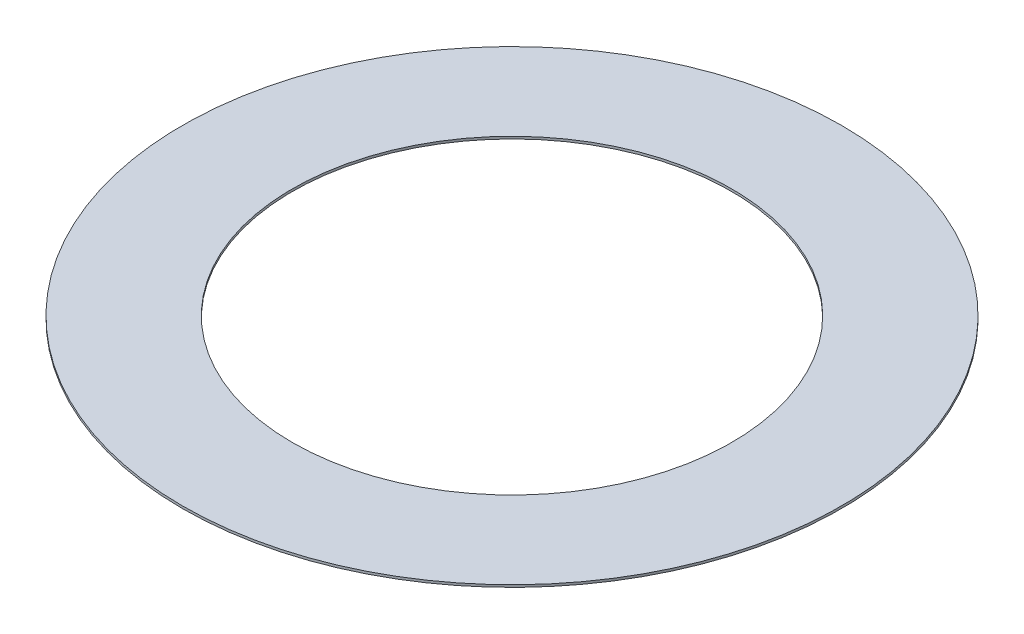
ISO-10303-21;
HEADER;
FILE_DESCRIPTION(('STEP AP214'),'2;1');
FILE_NAME('part.step','',(''),(''),'','','');
FILE_SCHEMA(('AUTOMOTIVE_DESIGN { 1 0 10303 214 1 1 1 1 }'));
ENDSEC;
DATA;
#1=APPLICATION_CONTEXT('core data for automotive mechanical design processes');
#2=APPLICATION_PROTOCOL_DEFINITION('international standard','automotive_design',2000,#1);
#3=PRODUCT_CONTEXT('',#1,'mechanical');
#4=PRODUCT('Part','Part','',(#3));
#5=PRODUCT_RELATED_PRODUCT_CATEGORY('part','',(#4));
#6=PRODUCT_DEFINITION_FORMATION('','',#4);
#7=PRODUCT_DEFINITION_CONTEXT('part definition',#1,'design');
#8=PRODUCT_DEFINITION('design','',#6,#7);
#9=PRODUCT_DEFINITION_SHAPE('','',#8);
#10=(LENGTH_UNIT() NAMED_UNIT(*) SI_UNIT(.MILLI.,.METRE.));
#11=(NAMED_UNIT(*) PLANE_ANGLE_UNIT() SI_UNIT($,.RADIAN.));
#12=(NAMED_UNIT(*) SI_UNIT($,.STERADIAN.) SOLID_ANGLE_UNIT());
#13=UNCERTAINTY_MEASURE_WITH_UNIT(LENGTH_MEASURE(1.E-05),#10,'distance_accuracy_value','');
#14=(GEOMETRIC_REPRESENTATION_CONTEXT(3) GLOBAL_UNCERTAINTY_ASSIGNED_CONTEXT((#13)) GLOBAL_UNIT_ASSIGNED_CONTEXT((#10,
#11,#12)) REPRESENTATION_CONTEXT('',''));
#15=CARTESIAN_POINT('',(0.,0.,0.));
#16=DIRECTION('',(0.,0.,1.));
#17=DIRECTION('',(1.,0.,0.));
#18=AXIS2_PLACEMENT_3D('',#15,#16,#17);
#19=CARTESIAN_POINT('',(0.,0.1016,0.));
#20=DIRECTION('',(0.,-1.,0.));
#21=DIRECTION('',(0.,0.,-1.));
#22=AXIS2_PLACEMENT_3D('',#19,#20,#21);
#23=CYLINDRICAL_SURFACE('',#22,14.2875);
#24=CARTESIAN_POINT('',(0.,0.1016,0.));
#25=DIRECTION('',(0.,1.,0.));
#26=DIRECTION('',(0.,0.,1.));
#27=AXIS2_PLACEMENT_3D('',#24,#25,#26);
#28=CIRCLE('',#27,14.2875);
#29=CARTESIAN_POINT('',(0.,0.1016,14.2875));
#30=VERTEX_POINT('',#29);
#31=EDGE_CURVE('E10',#30,#30,#28,.T.);
#32=ORIENTED_EDGE('',*,*,#31,.F.);
#33=EDGE_LOOP('',(#32));
#34=FACE_BOUND('',#33,.T.);
#35=CARTESIAN_POINT('',(0.,0.,0.));
#36=DIRECTION('',(0.,1.,0.));
#37=DIRECTION('',(0.,0.,1.));
#38=AXIS2_PLACEMENT_3D('',#35,#36,#37);
#39=CIRCLE('',#38,14.2875);
#40=CARTESIAN_POINT('',(0.,0.,14.2875));
#41=VERTEX_POINT('',#40);
#42=EDGE_CURVE('E33',#41,#41,#39,.T.);
#43=ORIENTED_EDGE('',*,*,#42,.T.);
#44=EDGE_LOOP('',(#43));
#45=FACE_BOUND('',#44,.T.);
#46=ADVANCED_FACE('F30',(#34,#45),#23,.T.);
#47=CARTESIAN_POINT('',(0.,0.1016,0.));
#48=DIRECTION('',(0.,1.,0.));
#49=DIRECTION('',(0.,0.,1.));
#50=AXIS2_PLACEMENT_3D('',#47,#48,#49);
#51=PLANE('',#50);
#52=CARTESIAN_POINT('',(0.,0.1016,0.));
#53=DIRECTION('',(0.,1.,0.));
#54=DIRECTION('',(0.,0.,1.));
#55=AXIS2_PLACEMENT_3D('',#52,#53,#54);
#56=CIRCLE('',#55,9.525);
#57=CARTESIAN_POINT('',(0.,0.1016,9.525));
#58=VERTEX_POINT('',#57);
#59=EDGE_CURVE('E42',#58,#58,#56,.T.);
#60=ORIENTED_EDGE('',*,*,#59,.F.);
#61=EDGE_LOOP('',(#60));
#62=FACE_BOUND('',#61,.T.);
#63=ORIENTED_EDGE('',*,*,#31,.T.);
#64=EDGE_LOOP('',(#63));
#65=FACE_BOUND('',#64,.T.);
#66=ADVANCED_FACE('F57',(#62,#65),#51,.T.);
#67=CARTESIAN_POINT('',(0.,0.,0.));
#68=DIRECTION('',(0.,1.,0.));
#69=DIRECTION('',(0.,0.,1.));
#70=AXIS2_PLACEMENT_3D('',#67,#68,#69);
#71=PLANE('',#70);
#72=CARTESIAN_POINT('',(0.,0.,0.));
#73=DIRECTION('',(0.,1.,0.));
#74=DIRECTION('',(0.,0.,1.));
#75=AXIS2_PLACEMENT_3D('',#72,#73,#74);
#76=CIRCLE('',#75,9.525);
#77=CARTESIAN_POINT('',(0.,0.,9.525));
#78=VERTEX_POINT('',#77);
#79=EDGE_CURVE('E40',#78,#78,#76,.T.);
#80=ORIENTED_EDGE('',*,*,#79,.T.);
#81=EDGE_LOOP('',(#80));
#82=FACE_BOUND('',#81,.T.);
#83=ORIENTED_EDGE('',*,*,#42,.F.);
#84=EDGE_LOOP('',(#83));
#85=FACE_BOUND('',#84,.T.);
#86=ADVANCED_FACE('F48',(#82,#85),#71,.F.);
#87=CARTESIAN_POINT('',(0.,0.,0.));
#88=DIRECTION('',(0.,1.,0.));
#89=DIRECTION('',(0.,0.,1.));
#90=AXIS2_PLACEMENT_3D('',#87,#88,#89);
#91=CYLINDRICAL_SURFACE('',#90,9.525);
#92=ORIENTED_EDGE('',*,*,#79,.F.);
#93=EDGE_LOOP('',(#92));
#94=FACE_BOUND('',#93,.T.);
#95=ORIENTED_EDGE('',*,*,#59,.T.);
#96=EDGE_LOOP('',(#95));
#97=FACE_BOUND('',#96,.T.);
#98=ADVANCED_FACE('F51',(#94,#97),#91,.F.);
#99=CLOSED_SHELL('',(#46,#66,#86,#98));
#100=MANIFOLD_SOLID_BREP('B2',#99);
#101=ADVANCED_BREP_SHAPE_REPRESENTATION('',(#18,#100),#14);
#102=SHAPE_DEFINITION_REPRESENTATION(#9,#101);
ENDSEC;
END-ISO-10303-21;
